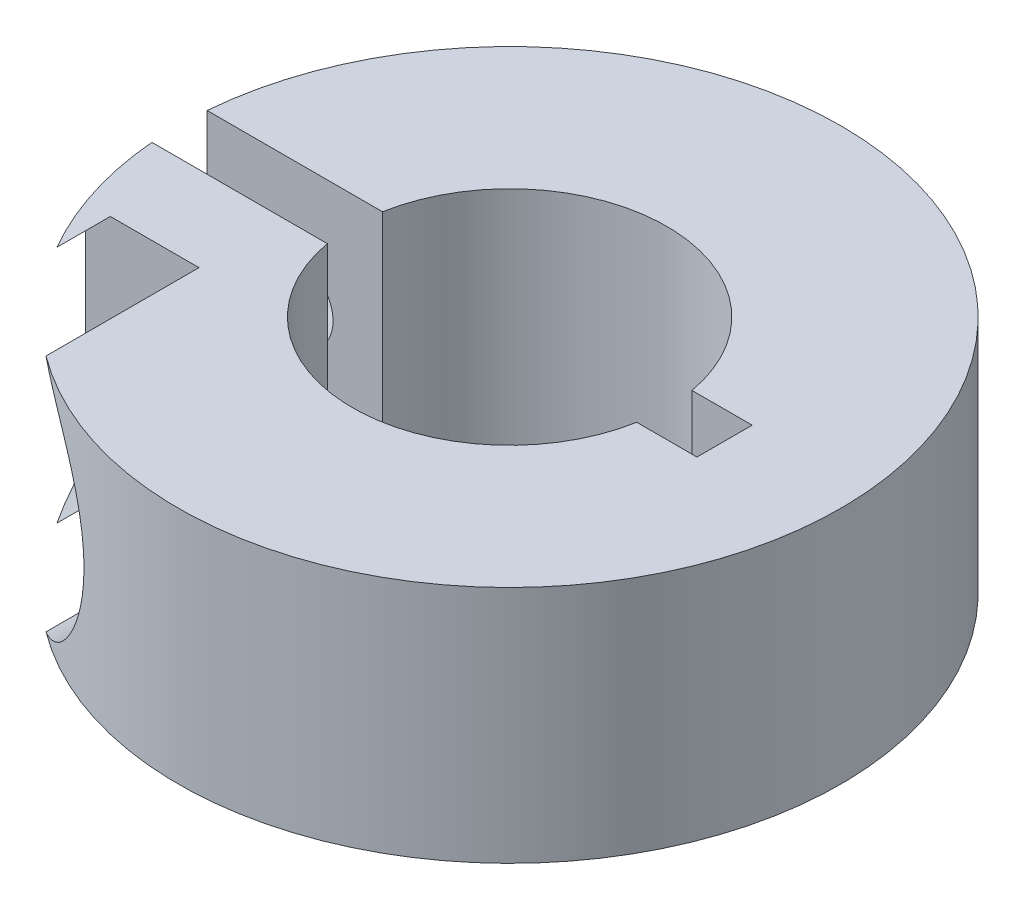
ISO-10303-21;
HEADER;
FILE_DESCRIPTION(('STEP AP214'),'2;1');
FILE_NAME('part.step','',(''),(''),'','','');
FILE_SCHEMA(('AUTOMOTIVE_DESIGN { 1 0 10303 214 1 1 1 1 }'));
ENDSEC;
DATA;
#1=APPLICATION_CONTEXT('core data for automotive mechanical design processes');
#2=APPLICATION_PROTOCOL_DEFINITION('international standard','automotive_design',2000,#1);
#3=PRODUCT_CONTEXT('',#1,'mechanical');
#4=PRODUCT('Part','Part','',(#3));
#5=PRODUCT_RELATED_PRODUCT_CATEGORY('part','',(#4));
#6=PRODUCT_DEFINITION_FORMATION('','',#4);
#7=PRODUCT_DEFINITION_CONTEXT('part definition',#1,'design');
#8=PRODUCT_DEFINITION('design','',#6,#7);
#9=PRODUCT_DEFINITION_SHAPE('','',#8);
#10=(LENGTH_UNIT() NAMED_UNIT(*) SI_UNIT(.MILLI.,.METRE.));
#11=(NAMED_UNIT(*) PLANE_ANGLE_UNIT() SI_UNIT($,.RADIAN.));
#12=(NAMED_UNIT(*) SI_UNIT($,.STERADIAN.) SOLID_ANGLE_UNIT());
#13=UNCERTAINTY_MEASURE_WITH_UNIT(LENGTH_MEASURE(1.E-05),#10,'distance_accuracy_value','');
#14=(GEOMETRIC_REPRESENTATION_CONTEXT(3) GLOBAL_UNCERTAINTY_ASSIGNED_CONTEXT((#13)) GLOBAL_UNIT_ASSIGNED_CONTEXT((#10,
#11,#12)) REPRESENTATION_CONTEXT('',''));
#15=CARTESIAN_POINT('',(0.,0.,0.));
#16=DIRECTION('',(0.,0.,1.));
#17=DIRECTION('',(1.,0.,0.));
#18=AXIS2_PLACEMENT_3D('',#15,#16,#17);
#19=CARTESIAN_POINT('',(0.,7.14375,0.));
#20=DIRECTION('',(0.,-1.,0.));
#21=DIRECTION('',(0.,0.,-1.));
#22=AXIS2_PLACEMENT_3D('',#19,#20,#21);
#23=CYLINDRICAL_SURFACE('',#22,9.906);
#24=CARTESIAN_POINT('',(-6.10573292715475,3.571875,-7.80056801920593));
#25=CARTESIAN_POINT('',(-6.1057350489413,3.62575369929899,-7.800566693518));
#26=CARTESIAN_POINT('',(-6.10956696813322,3.67965000379962,-7.79757163512268));
#27=CARTESIAN_POINT('',(-6.12463986062359,3.78574356999591,-7.78573761964555));
#28=CARTESIAN_POINT('',(-6.13588512875823,3.83793982838394,-7.77689527499827));
#29=CARTESIAN_POINT('',(-6.16500561712694,3.93894035146011,-7.75383010711834));
#30=CARTESIAN_POINT('',(-6.18285495345865,3.98775698703036,-7.73962828546907));
#31=CARTESIAN_POINT('',(-6.22418832050123,4.08115755865156,-7.70642691315473));
#32=CARTESIAN_POINT('',(-6.24767318493989,4.12574086705488,-7.68742665258016));
#33=CARTESIAN_POINT('',(-6.30075843390701,4.21260979606582,-7.64398591791705));
#34=CARTESIAN_POINT('',(-6.33064523616629,4.25458755303057,-7.61928356229421));
#35=CARTESIAN_POINT('',(-6.39426314495168,4.33271224139657,-7.56597411412722));
#36=CARTESIAN_POINT('',(-6.42799622101025,4.36885616242038,-7.53736501959339));
#37=CARTESIAN_POINT('',(-6.51575579530607,4.45190016077073,-7.46180626034595));
#38=CARTESIAN_POINT('',(-6.57150307762869,4.49515621344526,-7.41283297538473));
#39=CARTESIAN_POINT('',(-6.68622901095135,4.56923333464289,-7.30952702776662));
#40=CARTESIAN_POINT('',(-6.7452147922947,4.60002560318586,-7.25518230952001));
#41=CARTESIAN_POINT('',(-6.8850279602614,4.65896106383134,-7.12301680485367));
#42=CARTESIAN_POINT('',(-6.96631072978437,4.68245070182758,-7.04360926417904));
#43=CARTESIAN_POINT('',(-7.12753106500163,4.71138455134869,-6.8804335242109));
#44=CARTESIAN_POINT('',(-7.20746752401683,4.71681457530367,-6.79666194899151));
#45=CARTESIAN_POINT('',(-7.36606231466442,4.71167044108542,-6.62449970695025));
#46=CARTESIAN_POINT('',(-7.44463683465661,4.70068695875577,-6.53604577672108));
#47=CARTESIAN_POINT('',(-7.59705336125549,4.663336871144,-6.35825141619165));
#48=CARTESIAN_POINT('',(-7.67089133237031,4.63695733682234,-6.26891030292576));
#49=CARTESIAN_POINT('',(-7.81276605008313,4.56912684433371,-6.09117456914713));
#50=CARTESIAN_POINT('',(-7.88080165894988,4.52767293872308,-6.00278013721795));
#51=CARTESIAN_POINT('',(-7.97732585473248,4.45348479837669,-5.873161843182));
#52=CARTESIAN_POINT('',(-8.00855982306073,4.42677628072664,-5.83047912214276));
#53=CARTESIAN_POINT('',(-8.06894476461843,4.36902505032643,-5.74661853877683));
#54=CARTESIAN_POINT('',(-8.09809723590521,4.3379855031416,-5.70543960481547));
#55=CARTESIAN_POINT('',(-8.15439169065024,4.27058207975104,-5.62469491784271));
#56=CARTESIAN_POINT('',(-8.18149434301488,4.23414140223686,-5.58516521918445));
#57=CARTESIAN_POINT('',(-8.23251342890581,4.15566761860653,-5.50968461681487));
#58=CARTESIAN_POINT('',(-8.25643178657694,4.11363792069259,-5.47373155523227));
#59=CARTESIAN_POINT('',(-8.29570413775246,4.03222238927771,-5.41397706890652));
#60=CARTESIAN_POINT('',(-8.31181696650911,3.99394841033706,-5.38917730097792));
#61=CARTESIAN_POINT('',(-8.34041154972958,3.9132109862059,-5.34481680407442));
#62=CARTESIAN_POINT('',(-8.35290050538421,3.87075607729741,-5.3252456911862));
#63=CARTESIAN_POINT('',(-8.37065227277297,3.79305054525829,-5.29728442475467));
#64=CARTESIAN_POINT('',(-8.37693756129748,3.75860487017719,-5.28732722151303));
#65=CARTESIAN_POINT('',(-8.38634669298778,3.68823420546992,-5.27239081587822));
#66=CARTESIAN_POINT('',(-8.38947403375899,3.65231089841805,-5.26740610624202));
#67=CARTESIAN_POINT('',(-8.39228189045153,3.57984094583201,-5.26293159537696));
#68=CARTESIAN_POINT('',(-8.39194934040612,3.54329245814719,-5.2634626238248));
#69=CARTESIAN_POINT('',(-8.38784138706758,3.47088448321799,-5.27000628330232));
#70=CARTESIAN_POINT('',(-8.38406368710717,3.43502547188953,-5.27602257101265));
#71=CARTESIAN_POINT('',(-8.37250236154519,3.35901202635484,-5.29435302987076));
#72=CARTESIAN_POINT('',(-8.36414640663409,3.31916514072256,-5.30756474779398));
#73=CARTESIAN_POINT('',(-8.34398213224878,3.24254832990167,-5.33920869427054));
#74=CARTESIAN_POINT('',(-8.33216759958424,3.2057840968218,-5.35765031624847));
#75=CARTESIAN_POINT('',(-8.29914267879337,3.11767906998827,-5.40873275746947));
#76=CARTESIAN_POINT('',(-8.27620872656012,3.06842636265578,-5.44382656294857));
#77=CARTESIAN_POINT('',(-8.22599947125754,2.97677724337478,-5.51940601974627));
#78=CARTESIAN_POINT('',(-8.19871338527439,2.93439840247834,-5.55990502127883));
#79=CARTESIAN_POINT('',(-8.14529744127804,2.8617147358485,-5.63780516513832));
#80=CARTESIAN_POINT('',(-8.11962673512141,2.83055430383518,-5.674735707809));
#81=CARTESIAN_POINT('',(-8.06632199846049,2.77215008775878,-5.75025477822815));
#82=CARTESIAN_POINT('',(-8.03868668435102,2.74490890019181,-5.78884438332017));
#83=CARTESIAN_POINT('',(-7.95316342569243,2.66849593460383,-5.90638470706624));
#84=CARTESIAN_POINT('',(-7.89271395641868,2.62470730295466,-5.98702483796582));
#85=CARTESIAN_POINT('',(-7.78765010828687,2.56272861641244,-6.12258647883994));
#86=CARTESIAN_POINT('',(-7.74452295887689,2.54087844063561,-6.17706465559456));
#87=CARTESIAN_POINT('',(-7.65612879298546,2.50285936029721,-6.28629242119767));
#88=CARTESIAN_POINT('',(-7.61086099962107,2.48669253657222,-6.34104210202695));
#89=CARTESIAN_POINT('',(-7.47229276316323,2.44683618436185,-6.50492230008969));
#90=CARTESIAN_POINT('',(-7.37608175921185,2.43170559890586,-6.613872971755));
#91=CARTESIAN_POINT('',(-7.20030904934757,2.42730414590693,-6.80421727310393));
#92=CARTESIAN_POINT('',(-7.12171568456772,2.43309555634825,-6.88642038411588));
#93=CARTESIAN_POINT('',(-6.96333634863371,2.46216363944658,-7.04651374883083));
#94=CARTESIAN_POINT('',(-6.88355270572568,2.4854096892809,-7.12441129963856));
#95=CARTESIAN_POINT('',(-6.74679798184848,2.54305785188575,-7.25368576583743));
#96=CARTESIAN_POINT('',(-6.68937676160314,2.57288034803913,-7.30662606672656));
#97=CARTESIAN_POINT('',(-6.57750356743759,2.64435588475946,-7.40749063863519));
#98=CARTESIAN_POINT('',(-6.52304802280331,2.68599430584959,-7.45542100863112));
#99=CARTESIAN_POINT('',(-6.43067318910416,2.77167536343881,-7.5351308645867));
#100=CARTESIAN_POINT('',(-6.39168478122789,2.81337057638586,-7.5681870456989));
#101=CARTESIAN_POINT('',(-6.31895991011984,2.90452313616341,-7.62901189165399));
#102=CARTESIAN_POINT('',(-6.28521829128153,2.95397276611439,-7.65678575308226));
#103=CARTESIAN_POINT('',(-6.22960689309109,3.05178782332077,-7.70207253204566));
#104=CARTESIAN_POINT('',(-6.20670819815122,3.09913903356025,-7.72050795590035));
#105=CARTESIAN_POINT('',(-6.16727573233391,3.19807653836598,-7.75204405424823));
#106=CARTESIAN_POINT('',(-6.150735208664,3.2496582687777,-7.7651503894407));
#107=CARTESIAN_POINT('',(-6.12733354557149,3.3462169775674,-7.78362384830934));
#108=CARTESIAN_POINT('',(-6.11926890266035,3.39072072901009,-7.78995705511974));
#109=CARTESIAN_POINT('',(-6.1084676437546,3.48077044401445,-7.79842974247946));
#110=CARTESIAN_POINT('',(-6.10573113302151,3.52631642814828,-7.80056914017673));
#111=CARTESIAN_POINT('',(-6.10573292715475,3.571875,-7.80056801920593));
#112=B_SPLINE_CURVE_WITH_KNOTS('',3,(#24,#25,#26,#27,#28,#29,#30,#31,#32,#33,#34,#35,#36,#37,
#38,#39,#40,#41,#42,#43,#44,#45,#46,#47,#48,#49,#50,#51,#52,#53,#54,#55,#56,#57,#58,#59,#60,#61,
#62,#63,#64,#65,#66,#67,#68,#69,#70,#71,#72,#73,#74,#75,#76,#77,#78,#79,#80,#81,#82,#83,#84,#85,
#86,#87,#88,#89,#90,#91,#92,#93,#94,#95,#96,#97,#98,#99,#100,#101,#102,#103,#104,#105,#106,#107,
#108,#109,#110,#111),.UNSPECIFIED.,.T.,.F.,(4,2,2,2,2,2,2,2,2,2,2,2,2,2,2,2,2,2,2,2,2,2,2,2,2,2,
2,2,2,2,2,2,2,2,2,2,2,2,2,2,2,2,2,4),(0.,0.161453889321575,0.323001397344295,0.483922331975707,
0.644867088165134,0.815667080210007,0.986554928663509,1.24279321787145,1.49962026072494,
1.84585093244833,2.19235353761436,2.54764272280186,2.90323069698041,3.25888823555643,
3.43647735224373,3.61393734177422,3.7942186008399,3.97439042369583,4.1190481379554,
4.26341639509292,4.37218579803096,4.4808346001446,4.58989385317103,4.69902586240883,
4.82673026712282,4.95466551026417,5.14762248203882,5.34106517340329,5.50498344732766,
5.66900982178615,5.99742746250199,6.21571818937789,6.43408875565275,6.87007853781615,
7.21058379649684,7.55049305664751,7.8004595305878,8.0501180672336,8.24726949673487,
8.44422595990544,8.61073390728735,8.77706452052584,8.91358346774422,9.05010511197653),.UNSPECIFIED.);
#113=CARTESIAN_POINT('',(-6.10573292715475,3.571875,-7.80056801920593));
#114=VERTEX_POINT('',#113);
#115=EDGE_CURVE('E188',#114,#114,#112,.T.);
#116=ORIENTED_EDGE('',*,*,#115,.T.);
#117=EDGE_LOOP('',(#116));
#118=FACE_BOUND('',#117,.T.);
#119=CARTESIAN_POINT('',(0.,7.14375,0.));
#120=DIRECTION('',(0.,1.,0.));
#121=DIRECTION('',(0.,0.,1.));
#122=AXIS2_PLACEMENT_3D('',#119,#120,#121);
#123=CIRCLE('',#122,9.906);
#124=CARTESIAN_POINT('',(-5.92290903825585,7.14375,7.94027609876049));
#125=VERTEX_POINT('',#124);
#126=CARTESIAN_POINT('',(-9.8715442434302,7.14375,-0.825500000000001));
#127=VERTEX_POINT('',#126);
#128=EDGE_CURVE('E231',#125,#127,#123,.T.);
#129=ORIENTED_EDGE('',*,*,#128,.F.);
#130=CARTESIAN_POINT('',(-5.92290903825585,7.14375,7.94027609876049));
#131=CARTESIAN_POINT('',(-5.83641346593055,7.11165701121272,8.00481671069962));
#132=CARTESIAN_POINT('',(-5.74969360582123,7.07588037591212,8.06728341322179));
#133=CARTESIAN_POINT('',(-5.57662939718006,6.9966684388201,8.18786196066597));
#134=CARTESIAN_POINT('',(-5.49028535324406,6.9532278050557,8.24597073332991));
#135=CARTESIAN_POINT('',(-5.31867383017508,6.8583043326034,8.35769589749168));
#136=CARTESIAN_POINT('',(-5.23341015985559,6.80679873162953,8.41129889308163));
#137=CARTESIAN_POINT('',(-5.06524385813485,6.69575454947664,8.5136256096636));
#138=CARTESIAN_POINT('',(-4.98234065971831,6.63621791750876,8.56235050963409));
#139=CARTESIAN_POINT('',(-4.81953840698573,6.50885401649419,8.65503927495681));
#140=CARTESIAN_POINT('',(-4.73965576225958,6.44098816250226,8.69897905520907));
#141=CARTESIAN_POINT('',(-4.58441455645973,6.29743596858798,8.78178341946501));
#142=CARTESIAN_POINT('',(-4.50905573276561,6.22175008333574,8.82064829823512));
#143=CARTESIAN_POINT('',(-4.3640616496785,6.06311889117348,8.89327650485102));
#144=CARTESIAN_POINT('',(-4.29441561785278,5.98018788612428,8.92704953999043));
#145=CARTESIAN_POINT('',(-4.16168235638004,5.80751238687642,8.9896954504254));
#146=CARTESIAN_POINT('',(-4.09859447786306,5.71776856826722,9.01856881067862));
#147=CARTESIAN_POINT('',(-3.9848606250359,5.53997599017052,9.06935884968816));
#148=CARTESIAN_POINT('',(-3.93361457437756,5.45241883832754,9.09165627876117));
#149=CARTESIAN_POINT('',(-3.83794996935827,5.27276265770147,9.13245216433319));
#150=CARTESIAN_POINT('',(-3.79353367464615,5.18066213898413,9.15094936419039));
#151=CARTESIAN_POINT('',(-3.71205146232882,4.9926099421704,9.18430454060988));
#152=CARTESIAN_POINT('',(-3.67498692623128,4.89665754431269,9.19916183330115));
#153=CARTESIAN_POINT('',(-3.60861857683818,4.70160235258824,9.22539880946981));
#154=CARTESIAN_POINT('',(-3.57931762661198,4.60249841153803,9.23677721023253));
#155=CARTESIAN_POINT('',(-3.52961829164495,4.40512824104929,9.25588011248052));
#156=CARTESIAN_POINT('',(-3.5089659092601,4.30693599960921,9.26370952078633));
#157=CARTESIAN_POINT('',(-3.47544874771459,4.10900176456348,9.27633621543975));
#158=CARTESIAN_POINT('',(-3.46258677020334,4.00925922663802,9.2811324109858));
#159=CARTESIAN_POINT('',(-3.44479423753193,3.80903656550505,9.28775101438412));
#160=CARTESIAN_POINT('',(-3.43985857627864,3.70855695906228,9.2895753367131));
#161=CARTESIAN_POINT('',(-3.43795010853417,3.50747457844685,9.2902818128017));
#162=CARTESIAN_POINT('',(-3.44098024140415,3.40687177250426,9.28916288050651));
#163=CARTESIAN_POINT('',(-3.45496904238869,3.20645777709532,9.2839689899245));
#164=CARTESIAN_POINT('',(-3.46591500709579,3.10664557799463,9.27989876786977));
#165=CARTESIAN_POINT('',(-3.49562007406623,2.90832305092073,9.2687500593274));
#166=CARTESIAN_POINT('',(-3.51438204929717,2.8098132154148,9.26167046665178));
#167=CARTESIAN_POINT('',(-3.55952887962279,2.61485788272191,9.24441307991399));
#168=CARTESIAN_POINT('',(-3.58591186898581,2.51841188647764,9.23423604411688));
#169=CARTESIAN_POINT('',(-3.64604572011967,2.32821172368577,9.21065846440181));
#170=CARTESIAN_POINT('',(-3.67979928296702,2.23445855826329,9.1972567385554));
#171=CARTESIAN_POINT('',(-3.7543027103678,2.05039463017272,9.16709654589217));
#172=CARTESIAN_POINT('',(-3.79504824828126,1.96008178061688,9.15034015388311));
#173=CARTESIAN_POINT('',(-3.88310997393867,1.78345595627997,9.11331857914927));
#174=CARTESIAN_POINT('',(-3.93042855422882,1.69714445329078,9.09305211811538));
#175=CARTESIAN_POINT('',(-4.0814284994617,1.44526707554243,9.02678496460748));
#176=CARTESIAN_POINT('',(-4.19427263125569,1.28646882250576,8.97527067889892));
#177=CARTESIAN_POINT('',(-4.43983574601833,0.990512141974018,8.8563730038764));
#178=CARTESIAN_POINT('',(-4.57265531153861,0.853470890036709,8.7889082547889));
#179=CARTESIAN_POINT('',(-4.85199376223786,0.604249746583059,8.63783365917039));
#180=CARTESIAN_POINT('',(-4.99852666970588,0.492095706728473,8.55420719169594));
#181=CARTESIAN_POINT('',(-5.27493397987526,0.309494170851695,8.38604468464697));
#182=CARTESIAN_POINT('',(-5.40371926509381,0.235244150206888,8.30379797519633));
#183=CARTESIAN_POINT('',(-5.59810377417943,0.137230871040489,8.17289262945405));
#184=CARTESIAN_POINT('',(-5.66301781555778,0.106816444668588,8.12806235715103));
#185=CARTESIAN_POINT('',(-5.79295798040541,0.0502506351068939,8.03597063461395));
#186=CARTESIAN_POINT('',(-5.85798407760069,0.024098361862488,7.98870969468897));
#187=CARTESIAN_POINT('',(-5.92290903825586,0.,7.94027609876049));
#188=B_SPLINE_CURVE_WITH_KNOTS('',3,(#130,#131,#132,#133,#134,#135,#136,#137,#138,#139,#140,
#141,#142,#143,#144,#145,#146,#147,#148,#149,#150,#151,#152,#153,#154,#155,#156,#157,#158,#159,
#160,#161,#162,#163,#164,#165,#166,#167,#168,#169,#170,#171,#172,#173,#174,#175,#176,#177,#178,
#179,#180,#181,#182,#183,#184,#185,#186,#187),.UNSPECIFIED.,.F.,.F.,(4,2,2,2,2,2,2,2,2,2,2,2,2,
2,2,2,2,2,2,2,2,2,2,2,2,2,2,2,4),(0.,0.337747315028247,0.675730539894684,1.01468546700133,
1.35355827390284,1.69406476626186,2.03455147211431,2.37438062135273,2.71417611550334,
3.02540949169287,3.33674562000046,3.64814019780738,3.9596494529427,4.26122941290099,
4.56291776522633,4.86441169335774,5.16601688772433,5.46713913407067,5.76837216313057,
6.06953150851015,6.37080140481255,6.67188554291819,6.97307956234251,7.57453099207651,
8.17911912409512,8.78433236409413,9.2926467416775,9.54617091555019,9.79964207858663),.UNSPECIFIED.);
#189=CARTESIAN_POINT('',(-5.92290903825586,0.,7.94027609876049));
#190=VERTEX_POINT('',#189);
#191=EDGE_CURVE('E154',#125,#190,#188,.T.);
#192=ORIENTED_EDGE('',*,*,#191,.T.);
#193=CARTESIAN_POINT('',(0.,0.,0.));
#194=DIRECTION('',(0.,1.,0.));
#195=DIRECTION('',(0.,0.,1.));
#196=AXIS2_PLACEMENT_3D('',#193,#194,#195);
#197=CIRCLE('',#196,9.906);
#198=CARTESIAN_POINT('',(-9.8715442434302,0.,-0.8255));
#199=VERTEX_POINT('',#198);
#200=EDGE_CURVE('E234',#190,#199,#197,.T.);
#201=ORIENTED_EDGE('',*,*,#200,.T.);
#202=DIRECTION('',(0.,-1.,0.));
#203=VECTOR('',#202,1.);
#204=CARTESIAN_POINT('',(-9.8715442434302,7.14375,-0.825500000000001));
#205=LINE('',#204,#203);
#206=EDGE_CURVE('E204',#199,#127,#205,.F.);
#207=ORIENTED_EDGE('',*,*,#206,.T.);
#208=EDGE_LOOP('',(#129,#192,#201,#207));
#209=FACE_BOUND('',#208,.T.);
#210=ADVANCED_FACE('F33',(#118,#209),#23,.T.);
#211=CARTESIAN_POINT('',(0.,7.14375,0.));
#212=DIRECTION('',(0.,-1.,0.));
#213=DIRECTION('',(0.,0.,-1.));
#214=AXIS2_PLACEMENT_3D('',#211,#212,#213);
#215=CYLINDRICAL_SURFACE('',#214,4.699);
#216=CARTESIAN_POINT('',(0.,0.,0.));
#217=DIRECTION('',(0.,-1.,0.));
#218=DIRECTION('',(0.,0.,-1.));
#219=AXIS2_PLACEMENT_3D('',#216,#217,#218);
#220=CIRCLE('',#219,4.699);
#221=CARTESIAN_POINT('',(4.62592161087929,0.,0.825499999999999));
#222=VERTEX_POINT('',#221);
#223=CARTESIAN_POINT('',(-4.62592161087929,0.,0.825499999999999));
#224=VERTEX_POINT('',#223);
#225=EDGE_CURVE('E225',#222,#224,#220,.T.);
#226=ORIENTED_EDGE('',*,*,#225,.T.);
#227=DIRECTION('',(0.,-1.,0.));
#228=VECTOR('',#227,1.);
#229=CARTESIAN_POINT('',(-4.62592161087929,7.14375,0.825499999999999));
#230=LINE('',#229,#228);
#231=CARTESIAN_POINT('',(-4.62592161087929,7.14375,0.825499999999999));
#232=VERTEX_POINT('',#231);
#233=EDGE_CURVE('E242',#224,#232,#230,.F.);
#234=ORIENTED_EDGE('',*,*,#233,.T.);
#235=CARTESIAN_POINT('',(0.,7.14375,0.));
#236=DIRECTION('',(0.,-1.,0.));
#237=DIRECTION('',(0.,0.,-1.));
#238=AXIS2_PLACEMENT_3D('',#235,#236,#237);
#239=CIRCLE('',#238,4.699);
#240=CARTESIAN_POINT('',(4.62592161087929,7.14375,0.825499999999999));
#241=VERTEX_POINT('',#240);
#242=EDGE_CURVE('E224',#241,#232,#239,.T.);
#243=ORIENTED_EDGE('',*,*,#242,.F.);
#244=DIRECTION('',(0.,-1.,0.));
#245=VECTOR('',#244,1.);
#246=CARTESIAN_POINT('',(4.62592161087929,7.14375,0.825499999999999));
#247=LINE('',#246,#245);
#248=EDGE_CURVE('E239',#241,#222,#247,.T.);
#249=ORIENTED_EDGE('',*,*,#248,.T.);
#250=EDGE_LOOP('',(#226,#234,#243,#249));
#251=FACE_BOUND('',#250,.T.);
#252=ADVANCED_FACE('F271',(#251),#215,.F.);
#253=CARTESIAN_POINT('',(-9.8715442434302,0.,0.825499999999999));
#254=VERTEX_POINT('',#253);
#255=CARTESIAN_POINT('',(-8.57455681605363,0.,4.96042451895684));
#256=VERTEX_POINT('',#255);
#257=EDGE_CURVE('E232',#254,#256,#197,.T.);
#258=ORIENTED_EDGE('',*,*,#257,.T.);
#259=CARTESIAN_POINT('',(-8.57455681605363,0.,4.96042451895684));
#260=CARTESIAN_POINT('',(-8.64849796042377,0.0274477260913219,4.8326052955557));
#261=CARTESIAN_POINT('',(-8.71943790842941,0.0563895729168199,4.70339056892363));
#262=CARTESIAN_POINT('',(-8.85517008843624,0.116306256929,4.4425647007412));
#263=CARTESIAN_POINT('',(-8.9199740928715,0.147276999941407,4.31095875029708));
#264=CARTESIAN_POINT('',(-9.04357722531865,0.210409961369909,4.04524661106095));
#265=CARTESIAN_POINT('',(-9.10237651301845,0.24257214807004,3.9111404888701));
#266=CARTESIAN_POINT('',(-9.21406063812016,0.30725199051849,3.64024839607053));
#267=CARTESIAN_POINT('',(-9.26693364260757,0.339770219980766,3.50345768298569));
#268=CARTESIAN_POINT('',(-9.3167722817508,0.371982309948986,3.3655));
#269=B_SPLINE_CURVE_WITH_KNOTS('',3,(#259,#260,#261,#262,#263,#264,#265,#266,#267,#268),
.UNSPECIFIED.,.F.,.F.,(4,2,2,2,4),(0.,0.450516278585522,0.900149895749015,1.34977155235456,
1.80027554359824),.UNSPECIFIED.);
#270=CARTESIAN_POINT('',(-9.3167722817508,0.371982309948987,3.3655));
#271=VERTEX_POINT('',#270);
#272=EDGE_CURVE('E152',#256,#271,#269,.T.);
#273=ORIENTED_EDGE('',*,*,#272,.T.);
#274=DIRECTION('',(0.,-1.,0.));
#275=VECTOR('',#274,1.);
#276=CARTESIAN_POINT('',(-9.3167722817508,7.14375,3.3655));
#277=LINE('',#276,#275);
#278=CARTESIAN_POINT('',(-9.3167722817508,6.77176769005101,3.3655));
#279=VERTEX_POINT('',#278);
#280=EDGE_CURVE('E143',#271,#279,#277,.F.);
#281=ORIENTED_EDGE('',*,*,#280,.T.);
#282=CARTESIAN_POINT('',(-9.3167722817508,6.77176769005102,3.3655));
#283=CARTESIAN_POINT('',(-9.26693364260757,6.80397978001923,3.50345768298569));
#284=CARTESIAN_POINT('',(-9.21406063812016,6.83649800948151,3.64024839607053));
#285=CARTESIAN_POINT('',(-9.10237651301845,6.90117785192996,3.91114048887009));
#286=CARTESIAN_POINT('',(-9.04357722531866,6.93334003863009,4.04524661106095));
#287=CARTESIAN_POINT('',(-8.9199740928715,6.99647300005859,4.31095875029707));
#288=CARTESIAN_POINT('',(-8.85517008843624,7.027443743071,4.4425647007412));
#289=CARTESIAN_POINT('',(-8.71943790842941,7.08736042708318,4.70339056892363));
#290=CARTESIAN_POINT('',(-8.64849796042377,7.11630227390868,4.83260529555569));
#291=CARTESIAN_POINT('',(-8.57455681605364,7.14375,4.96042451895683));
#292=B_SPLINE_CURVE_WITH_KNOTS('',3,(#282,#283,#284,#285,#286,#287,#288,#289,#290,#291),
.UNSPECIFIED.,.F.,.F.,(4,2,2,2,4),(0.,0.450503991243673,0.900125647849216,1.34975926501271,
1.80027554359823),.UNSPECIFIED.);
#293=CARTESIAN_POINT('',(-8.57455681605364,7.14375,4.96042451895683));
#294=VERTEX_POINT('',#293);
#295=EDGE_CURVE('E130',#279,#294,#292,.T.);
#296=ORIENTED_EDGE('',*,*,#295,.T.);
#297=CARTESIAN_POINT('',(-9.8715442434302,7.14375,0.825499999999999));
#298=VERTEX_POINT('',#297);
#299=EDGE_CURVE('E228',#298,#294,#123,.T.);
#300=ORIENTED_EDGE('',*,*,#299,.F.);
#301=DIRECTION('',(0.,-1.,0.));
#302=VECTOR('',#301,1.);
#303=CARTESIAN_POINT('',(-9.8715442434302,7.14375,0.825499999999999));
#304=LINE('',#303,#302);
#305=EDGE_CURVE('E215',#298,#254,#304,.T.);
#306=ORIENTED_EDGE('',*,*,#305,.T.);
#307=EDGE_LOOP('',(#258,#273,#281,#296,#300,#306));
#308=FACE_BOUND('',#307,.T.);
#309=ADVANCED_FACE('F35',(#308),#23,.T.);
#310=CARTESIAN_POINT('',(0.,7.14375,0.));
#311=DIRECTION('',(0.,1.,0.));
#312=DIRECTION('',(0.,0.,1.));
#313=AXIS2_PLACEMENT_3D('',#310,#311,#312);
#314=PLANE('',#313);
#315=DIRECTION('',(0.,0.,-1.));
#316=VECTOR('',#315,1.);
#317=CARTESIAN_POINT('',(-5.92290903825585,7.14375,19.6977));
#318=LINE('',#317,#316);
#319=CARTESIAN_POINT('',(-5.92290903825585,7.14375,3.3655));
#320=VERTEX_POINT('',#319);
#321=EDGE_CURVE('E290',#125,#320,#318,.T.);
#322=ORIENTED_EDGE('',*,*,#321,.F.);
#323=ORIENTED_EDGE('',*,*,#128,.T.);
#324=DIRECTION('',(-1.,0.,0.));
#325=VECTOR('',#324,1.);
#326=CARTESIAN_POINT('',(0.,7.14375,-0.825500000000001));
#327=LINE('',#326,#325);
#328=CARTESIAN_POINT('',(-4.62592161087928,7.14375,-0.825500000000001));
#329=VERTEX_POINT('',#328);
#330=EDGE_CURVE('E200',#329,#127,#327,.T.);
#331=ORIENTED_EDGE('',*,*,#330,.F.);
#332=CARTESIAN_POINT('',(4.62592161087929,7.14375,-0.825500000000001));
#333=VERTEX_POINT('',#332);
#334=EDGE_CURVE('E221',#329,#333,#239,.T.);
#335=ORIENTED_EDGE('',*,*,#334,.T.);
#336=CARTESIAN_POINT('',(6.4262,7.14375,-0.825500000000001));
#337=VERTEX_POINT('',#336);
#338=EDGE_CURVE('E205',#337,#333,#327,.T.);
#339=ORIENTED_EDGE('',*,*,#338,.F.);
#340=DIRECTION('',(0.,0.,-1.));
#341=VECTOR('',#340,1.);
#342=CARTESIAN_POINT('',(6.4262,7.14375,0.));
#343=LINE('',#342,#341);
#344=CARTESIAN_POINT('',(6.4262,7.14375,0.825499999999999));
#345=VERTEX_POINT('',#344);
#346=EDGE_CURVE('E218',#345,#337,#343,.T.);
#347=ORIENTED_EDGE('',*,*,#346,.F.);
#348=DIRECTION('',(1.,0.,0.));
#349=VECTOR('',#348,1.);
#350=CARTESIAN_POINT('',(0.,7.14375,0.825499999999999));
#351=LINE('',#350,#349);
#352=EDGE_CURVE('E211',#241,#345,#351,.T.);
#353=ORIENTED_EDGE('',*,*,#352,.F.);
#354=ORIENTED_EDGE('',*,*,#242,.T.);
#355=EDGE_CURVE('E214',#298,#232,#351,.T.);
#356=ORIENTED_EDGE('',*,*,#355,.F.);
#357=ORIENTED_EDGE('',*,*,#299,.T.);
#358=DIRECTION('',(0.,0.,-1.));
#359=VECTOR('',#358,1.);
#360=CARTESIAN_POINT('',(-8.57455681605364,7.14375,19.6977));
#361=LINE('',#360,#359);
#362=CARTESIAN_POINT('',(-8.57455681605364,7.14375,3.3655));
#363=VERTEX_POINT('',#362);
#364=EDGE_CURVE('E135',#363,#294,#361,.F.);
#365=ORIENTED_EDGE('',*,*,#364,.F.);
#366=DIRECTION('',(-1.,0.,0.));
#367=VECTOR('',#366,1.);
#368=CARTESIAN_POINT('',(0.,7.14375,3.3655));
#369=LINE('',#368,#367);
#370=EDGE_CURVE('E146',#320,#363,#369,.T.);
#371=ORIENTED_EDGE('',*,*,#370,.F.);
#372=EDGE_LOOP('',(#322,#323,#331,#335,#339,#347,#353,#354,#356,#357,#365,#371));
#373=FACE_BOUND('',#372,.T.);
#374=ADVANCED_FACE('F265',(#373),#314,.T.);
#375=CARTESIAN_POINT('',(0.,0.,0.));
#376=DIRECTION('',(0.,1.,0.));
#377=DIRECTION('',(0.,0.,1.));
#378=AXIS2_PLACEMENT_3D('',#375,#376,#377);
#379=PLANE('',#378);
#380=ORIENTED_EDGE('',*,*,#200,.F.);
#381=DIRECTION('',(0.,0.,-1.));
#382=VECTOR('',#381,1.);
#383=CARTESIAN_POINT('',(-5.92290903825586,0.,19.6977));
#384=LINE('',#383,#382);
#385=CARTESIAN_POINT('',(-5.92290903825586,0.,3.3655));
#386=VERTEX_POINT('',#385);
#387=EDGE_CURVE('E11',#190,#386,#384,.T.);
#388=ORIENTED_EDGE('',*,*,#387,.T.);
#389=DIRECTION('',(-1.,0.,0.));
#390=VECTOR('',#389,1.);
#391=CARTESIAN_POINT('',(0.,0.,3.3655));
#392=LINE('',#391,#390);
#393=CARTESIAN_POINT('',(-8.57455681605363,0.,3.3655));
#394=VERTEX_POINT('',#393);
#395=EDGE_CURVE('E156',#386,#394,#392,.T.);
#396=ORIENTED_EDGE('',*,*,#395,.T.);
#397=DIRECTION('',(0.,0.,-1.));
#398=VECTOR('',#397,1.);
#399=CARTESIAN_POINT('',(-8.57455681605363,0.,19.6977));
#400=LINE('',#399,#398);
#401=EDGE_CURVE('E42',#394,#256,#400,.F.);
#402=ORIENTED_EDGE('',*,*,#401,.T.);
#403=ORIENTED_EDGE('',*,*,#257,.F.);
#404=DIRECTION('',(1.,0.,0.));
#405=VECTOR('',#404,1.);
#406=CARTESIAN_POINT('',(0.,0.,0.825499999999999));
#407=LINE('',#406,#405);
#408=EDGE_CURVE('E212',#254,#224,#407,.T.);
#409=ORIENTED_EDGE('',*,*,#408,.T.);
#410=ORIENTED_EDGE('',*,*,#225,.F.);
#411=CARTESIAN_POINT('',(6.4262,0.,0.825499999999999));
#412=VERTEX_POINT('',#411);
#413=EDGE_CURVE('E208',#222,#412,#407,.T.);
#414=ORIENTED_EDGE('',*,*,#413,.T.);
#415=DIRECTION('',(0.,0.,-1.));
#416=VECTOR('',#415,1.);
#417=CARTESIAN_POINT('',(6.4262,0.,0.));
#418=LINE('',#417,#416);
#419=CARTESIAN_POINT('',(6.4262,0.,-0.8255));
#420=VERTEX_POINT('',#419);
#421=EDGE_CURVE('E245',#412,#420,#418,.T.);
#422=ORIENTED_EDGE('',*,*,#421,.T.);
#423=DIRECTION('',(-1.,0.,0.));
#424=VECTOR('',#423,1.);
#425=CARTESIAN_POINT('',(0.,0.,-0.8255));
#426=LINE('',#425,#424);
#427=CARTESIAN_POINT('',(4.62592161087928,0.,-0.825500000000001));
#428=VERTEX_POINT('',#427);
#429=EDGE_CURVE('E201',#420,#428,#426,.T.);
#430=ORIENTED_EDGE('',*,*,#429,.T.);
#431=CARTESIAN_POINT('',(-4.62592161087929,0.,-0.825500000000001));
#432=VERTEX_POINT('',#431);
#433=EDGE_CURVE('E220',#432,#428,#220,.T.);
#434=ORIENTED_EDGE('',*,*,#433,.F.);
#435=EDGE_CURVE('E57',#432,#199,#426,.T.);
#436=ORIENTED_EDGE('',*,*,#435,.T.);
#437=EDGE_LOOP('',(#380,#388,#396,#402,#403,#409,#410,#414,#422,#430,#434,#436));
#438=FACE_BOUND('',#437,.T.);
#439=ADVANCED_FACE('F256',(#438),#379,.F.);
#440=ORIENTED_EDGE('',*,*,#433,.T.);
#441=DIRECTION('',(0.,-1.,0.));
#442=VECTOR('',#441,1.);
#443=CARTESIAN_POINT('',(4.62592161087928,7.14375,-0.825500000000001));
#444=LINE('',#443,#442);
#445=EDGE_CURVE('E236',#428,#333,#444,.F.);
#446=ORIENTED_EDGE('',*,*,#445,.T.);
#447=ORIENTED_EDGE('',*,*,#334,.F.);
#448=DIRECTION('',(0.,-1.,0.));
#449=VECTOR('',#448,1.);
#450=CARTESIAN_POINT('',(-4.62592161087928,7.14375,-0.825500000000001));
#451=LINE('',#450,#449);
#452=EDGE_CURVE('E230',#329,#432,#451,.T.);
#453=ORIENTED_EDGE('',*,*,#452,.T.);
#454=EDGE_LOOP('',(#440,#446,#447,#453));
#455=FACE_BOUND('',#454,.T.);
#456=ADVANCED_FACE('F285',(#455),#215,.F.);
#457=CARTESIAN_POINT('',(6.4262,11.9422453807658,-0.825500000000002));
#458=DIRECTION('',(0.,0.,-1.));
#459=DIRECTION('',(0.,1.,0.));
#460=AXIS2_PLACEMENT_3D('',#457,#458,#459);
#461=PLANE('',#460);
#462=CARTESIAN_POINT('',(-7.24873292715475,3.571875,-0.8255));
#463=DIRECTION('',(0.,0.,-1.));
#464=DIRECTION('',(0.,1.,0.));
#465=AXIS2_PLACEMENT_3D('',#462,#463,#464);
#466=CIRCLE('',#465,1.143);
#467=CARTESIAN_POINT('',(-7.24873292715475,4.714875,-0.8255));
#468=VERTEX_POINT('',#467);
#469=EDGE_CURVE('E185',#468,#468,#466,.T.);
#470=ORIENTED_EDGE('',*,*,#469,.T.);
#471=EDGE_LOOP('',(#470));
#472=FACE_BOUND('',#471,.T.);
#473=ORIENTED_EDGE('',*,*,#435,.F.);
#474=ORIENTED_EDGE('',*,*,#452,.F.);
#475=ORIENTED_EDGE('',*,*,#330,.T.);
#476=ORIENTED_EDGE('',*,*,#206,.F.);
#477=EDGE_LOOP('',(#473,#474,#475,#476));
#478=FACE_BOUND('',#477,.T.);
#479=ADVANCED_FACE('F288',(#472,#478),#461,.F.);
#480=ORIENTED_EDGE('',*,*,#338,.T.);
#481=ORIENTED_EDGE('',*,*,#445,.F.);
#482=ORIENTED_EDGE('',*,*,#429,.F.);
#483=DIRECTION('',(0.,-1.,0.));
#484=VECTOR('',#483,1.);
#485=CARTESIAN_POINT('',(6.4262,11.9422453807658,-0.825500000000002));
#486=LINE('',#485,#484);
#487=EDGE_CURVE('E196',#337,#420,#486,.T.);
#488=ORIENTED_EDGE('',*,*,#487,.F.);
#489=EDGE_LOOP('',(#480,#481,#482,#488));
#490=FACE_BOUND('',#489,.T.);
#491=ADVANCED_FACE('F281',(#490),#461,.F.);
#492=CARTESIAN_POINT('',(6.4262,11.9422453807658,0.825499999999999));
#493=DIRECTION('',(0.,0.,1.));
#494=DIRECTION('',(1.,0.,0.));
#495=AXIS2_PLACEMENT_3D('',#492,#493,#494);
#496=PLANE('',#495);
#497=ORIENTED_EDGE('',*,*,#352,.T.);
#498=DIRECTION('',(0.,1.,0.));
#499=VECTOR('',#498,1.);
#500=CARTESIAN_POINT('',(6.4262,11.9422453807658,0.825499999999999));
#501=LINE('',#500,#499);
#502=EDGE_CURVE('E193',#412,#345,#501,.T.);
#503=ORIENTED_EDGE('',*,*,#502,.F.);
#504=ORIENTED_EDGE('',*,*,#413,.F.);
#505=ORIENTED_EDGE('',*,*,#248,.F.);
#506=EDGE_LOOP('',(#497,#503,#504,#505));
#507=FACE_BOUND('',#506,.T.);
#508=ADVANCED_FACE('F273',(#507),#496,.F.);
#509=CARTESIAN_POINT('',(6.4262,0.,0.));
#510=DIRECTION('',(1.,0.,0.));
#511=DIRECTION('',(0.,0.,-1.));
#512=AXIS2_PLACEMENT_3D('',#509,#510,#511);
#513=PLANE('',#512);
#514=ORIENTED_EDGE('',*,*,#346,.T.);
#515=ORIENTED_EDGE('',*,*,#487,.T.);
#516=ORIENTED_EDGE('',*,*,#421,.F.);
#517=ORIENTED_EDGE('',*,*,#502,.T.);
#518=EDGE_LOOP('',(#514,#515,#516,#517));
#519=FACE_BOUND('',#518,.T.);
#520=ADVANCED_FACE('F279',(#519),#513,.F.);
#521=CARTESIAN_POINT('',(-7.24873292715475,3.571875,0.825499999999998));
#522=DIRECTION('',(0.,0.,1.));
#523=DIRECTION('',(1.,0.,0.));
#524=AXIS2_PLACEMENT_3D('',#521,#522,#523);
#525=CIRCLE('',#524,1.143);
#526=CARTESIAN_POINT('',(-6.10573292715475,3.571875,0.825499999999998));
#527=VERTEX_POINT('',#526);
#528=EDGE_CURVE('E140',#527,#527,#525,.T.);
#529=ORIENTED_EDGE('',*,*,#528,.T.);
#530=EDGE_LOOP('',(#529));
#531=FACE_BOUND('',#530,.T.);
#532=ORIENTED_EDGE('',*,*,#355,.T.);
#533=ORIENTED_EDGE('',*,*,#233,.F.);
#534=ORIENTED_EDGE('',*,*,#408,.F.);
#535=ORIENTED_EDGE('',*,*,#305,.F.);
#536=EDGE_LOOP('',(#532,#533,#534,#535));
#537=FACE_BOUND('',#536,.T.);
#538=ADVANCED_FACE('F261',(#531,#537),#496,.F.);
#539=CARTESIAN_POINT('',(-7.24873292715475,3.571875,-9.906));
#540=DIRECTION('',(0.,0.,1.));
#541=DIRECTION('',(1.,0.,0.));
#542=AXIS2_PLACEMENT_3D('',#539,#540,#541);
#543=CYLINDRICAL_SURFACE('',#542,1.143);
#544=CARTESIAN_POINT('',(-7.24873292715475,3.571875,3.3655));
#545=DIRECTION('',(0.,0.,-1.));
#546=DIRECTION('',(-1.,0.,0.));
#547=AXIS2_PLACEMENT_3D('',#544,#545,#546);
#548=CIRCLE('',#547,1.143);
#549=CARTESIAN_POINT('',(-8.39173292715475,3.571875,3.3655));
#550=VERTEX_POINT('',#549);
#551=EDGE_CURVE('E147',#550,#550,#548,.F.);
#552=ORIENTED_EDGE('',*,*,#551,.T.);
#553=EDGE_LOOP('',(#552));
#554=FACE_BOUND('',#553,.T.);
#555=ORIENTED_EDGE('',*,*,#528,.F.);
#556=EDGE_LOOP('',(#555));
#557=FACE_BOUND('',#556,.T.);
#558=ADVANCED_FACE('F323',(#554,#557),#543,.F.);
#559=ORIENTED_EDGE('',*,*,#469,.F.);
#560=EDGE_LOOP('',(#559));
#561=FACE_BOUND('',#560,.T.);
#562=ORIENTED_EDGE('',*,*,#115,.F.);
#563=EDGE_LOOP('',(#562));
#564=FACE_BOUND('',#563,.T.);
#565=ADVANCED_FACE('F175',(#561,#564),#543,.F.);
#566=CARTESIAN_POINT('',(-7.24873292715475,3.571875,19.6977));
#567=DIRECTION('',(0.,0.,-1.));
#568=DIRECTION('',(-1.,0.,0.));
#569=AXIS2_PLACEMENT_3D('',#566,#567,#568);
#570=CYLINDRICAL_SURFACE('',#569,3.81);
#571=CARTESIAN_POINT('',(-7.24873292715475,3.571875,3.3655));
#572=DIRECTION('',(0.,0.,-1.));
#573=DIRECTION('',(-1.,0.,0.));
#574=AXIS2_PLACEMENT_3D('',#571,#572,#573);
#575=CIRCLE('',#574,3.81);
#576=EDGE_CURVE('E133',#279,#363,#575,.T.);
#577=ORIENTED_EDGE('',*,*,#576,.T.);
#578=ORIENTED_EDGE('',*,*,#364,.T.);
#579=ORIENTED_EDGE('',*,*,#295,.F.);
#580=EDGE_LOOP('',(#577,#578,#579));
#581=FACE_BOUND('',#580,.T.);
#582=ADVANCED_FACE('F132',(#581),#570,.F.);
#583=ORIENTED_EDGE('',*,*,#401,.F.);
#584=EDGE_CURVE('E49',#394,#271,#575,.T.);
#585=ORIENTED_EDGE('',*,*,#584,.T.);
#586=ORIENTED_EDGE('',*,*,#272,.F.);
#587=EDGE_LOOP('',(#583,#585,#586));
#588=FACE_BOUND('',#587,.T.);
#589=ADVANCED_FACE('F174',(#588),#570,.F.);
#590=CARTESIAN_POINT('',(-7.24873292715475,3.571875,3.3655));
#591=DIRECTION('',(0.,0.,-1.));
#592=DIRECTION('',(-1.,0.,0.));
#593=AXIS2_PLACEMENT_3D('',#590,#591,#592);
#594=PLANE('',#593);
#595=ORIENTED_EDGE('',*,*,#551,.F.);
#596=EDGE_LOOP('',(#595));
#597=FACE_BOUND('',#596,.T.);
#598=ORIENTED_EDGE('',*,*,#584,.F.);
#599=ORIENTED_EDGE('',*,*,#395,.F.);
#600=EDGE_CURVE('E148',#320,#386,#575,.T.);
#601=ORIENTED_EDGE('',*,*,#600,.F.);
#602=ORIENTED_EDGE('',*,*,#370,.T.);
#603=ORIENTED_EDGE('',*,*,#576,.F.);
#604=ORIENTED_EDGE('',*,*,#280,.F.);
#605=EDGE_LOOP('',(#598,#599,#601,#602,#603,#604));
#606=FACE_BOUND('',#605,.T.);
#607=ADVANCED_FACE('F142',(#597,#606),#594,.F.);
#608=ORIENTED_EDGE('',*,*,#321,.T.);
#609=ORIENTED_EDGE('',*,*,#600,.T.);
#610=ORIENTED_EDGE('',*,*,#387,.F.);
#611=ORIENTED_EDGE('',*,*,#191,.F.);
#612=EDGE_LOOP('',(#608,#609,#610,#611));
#613=FACE_BOUND('',#612,.T.);
#614=ADVANCED_FACE('F168',(#613),#570,.F.);
#615=CLOSED_SHELL('',(#210,#252,#309,#374,#439,#456,#479,#491,#508,#520,#538,#558,#565,#582,
#589,#607,#614));
#616=MANIFOLD_SOLID_BREP('B2',#615);
#617=ADVANCED_BREP_SHAPE_REPRESENTATION('',(#18,#616),#14);
#618=SHAPE_DEFINITION_REPRESENTATION(#9,#617);
ENDSEC;
END-ISO-10303-21;
